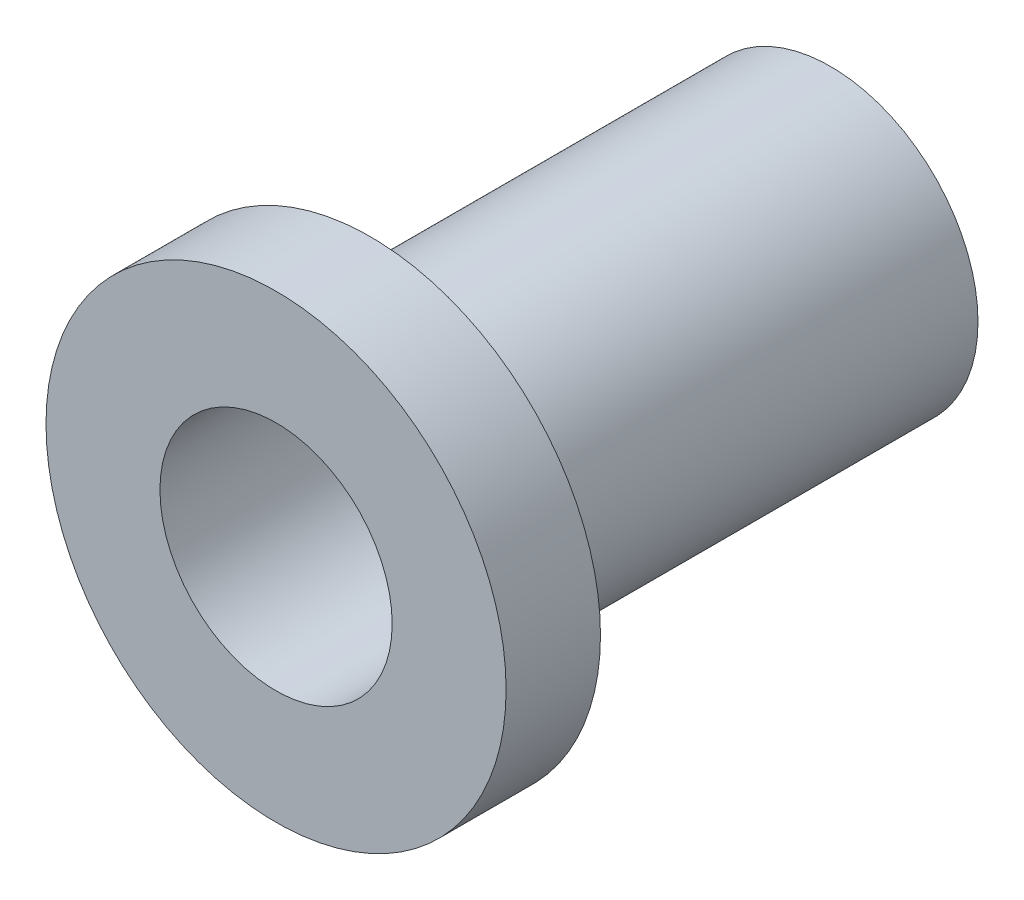
ISO-10303-21;
HEADER;
FILE_DESCRIPTION(('STEP AP214'),'2;1');
FILE_NAME('part.step','',(''),(''),'','','');
FILE_SCHEMA(('AUTOMOTIVE_DESIGN { 1 0 10303 214 1 1 1 1 }'));
ENDSEC;
DATA;
#1=APPLICATION_CONTEXT('core data for automotive mechanical design processes');
#2=APPLICATION_PROTOCOL_DEFINITION('international standard','automotive_design',2000,#1);
#3=PRODUCT_CONTEXT('',#1,'mechanical');
#4=PRODUCT('Part','Part','',(#3));
#5=PRODUCT_RELATED_PRODUCT_CATEGORY('part','',(#4));
#6=PRODUCT_DEFINITION_FORMATION('','',#4);
#7=PRODUCT_DEFINITION_CONTEXT('part definition',#1,'design');
#8=PRODUCT_DEFINITION('design','',#6,#7);
#9=PRODUCT_DEFINITION_SHAPE('','',#8);
#10=(LENGTH_UNIT() NAMED_UNIT(*) SI_UNIT(.MILLI.,.METRE.));
#11=(NAMED_UNIT(*) PLANE_ANGLE_UNIT() SI_UNIT($,.RADIAN.));
#12=(NAMED_UNIT(*) SI_UNIT($,.STERADIAN.) SOLID_ANGLE_UNIT());
#13=UNCERTAINTY_MEASURE_WITH_UNIT(LENGTH_MEASURE(1.E-05),#10,'distance_accuracy_value','');
#14=(GEOMETRIC_REPRESENTATION_CONTEXT(3) GLOBAL_UNCERTAINTY_ASSIGNED_CONTEXT((#13)) GLOBAL_UNIT_ASSIGNED_CONTEXT((#10,
#11,#12)) REPRESENTATION_CONTEXT('',''));
#15=CARTESIAN_POINT('',(0.,0.,0.));
#16=DIRECTION('',(0.,0.,1.));
#17=DIRECTION('',(1.,0.,0.));
#18=AXIS2_PLACEMENT_3D('',#15,#16,#17);
#19=CARTESIAN_POINT('',(0.,0.,2.032));
#20=DIRECTION('',(0.,0.,1.));
#21=DIRECTION('',(1.,0.,0.));
#22=AXIS2_PLACEMENT_3D('',#19,#20,#21);
#23=PLANE('',#22);
#24=CARTESIAN_POINT('',(0.,0.,2.032));
#25=DIRECTION('',(0.,0.,-1.));
#26=DIRECTION('',(-1.,0.,0.));
#27=AXIS2_PLACEMENT_3D('',#24,#25,#26);
#28=CIRCLE('',#27,2.5);
#29=CARTESIAN_POINT('',(-2.5,0.,2.032));
#30=VERTEX_POINT('',#29);
#31=EDGE_CURVE('E17',#30,#30,#28,.T.);
#32=ORIENTED_EDGE('',*,*,#31,.T.);
#33=EDGE_LOOP('',(#32));
#34=FACE_BOUND('',#33,.T.);
#35=CARTESIAN_POINT('',(0.,0.,2.032));
#36=DIRECTION('',(0.,0.,-1.));
#37=DIRECTION('',(-1.,0.,0.));
#38=AXIS2_PLACEMENT_3D('',#35,#36,#37);
#39=CIRCLE('',#38,4.953);
#40=CARTESIAN_POINT('',(-4.953,0.,2.032));
#41=VERTEX_POINT('',#40);
#42=EDGE_CURVE('E33',#41,#41,#39,.T.);
#43=ORIENTED_EDGE('',*,*,#42,.F.);
#44=EDGE_LOOP('',(#43));
#45=FACE_BOUND('',#44,.T.);
#46=ADVANCED_FACE('F14',(#34,#45),#23,.T.);
#47=CARTESIAN_POINT('',(0.,0.,2.032));
#48=DIRECTION('',(0.,0.,-1.));
#49=DIRECTION('',(-1.,0.,0.));
#50=AXIS2_PLACEMENT_3D('',#47,#48,#49);
#51=CYLINDRICAL_SURFACE('',#50,2.5);
#52=CARTESIAN_POINT('',(0.,0.,-9.906));
#53=DIRECTION('',(0.,0.,-1.));
#54=DIRECTION('',(-1.,0.,0.));
#55=AXIS2_PLACEMENT_3D('',#52,#53,#54);
#56=CIRCLE('',#55,2.5);
#57=CARTESIAN_POINT('',(-2.5,0.,-9.906));
#58=VERTEX_POINT('',#57);
#59=EDGE_CURVE('E31',#58,#58,#56,.F.);
#60=ORIENTED_EDGE('',*,*,#59,.F.);
#61=EDGE_LOOP('',(#60));
#62=FACE_BOUND('',#61,.T.);
#63=ORIENTED_EDGE('',*,*,#31,.F.);
#64=EDGE_LOOP('',(#63));
#65=FACE_BOUND('',#64,.T.);
#66=ADVANCED_FACE('F42',(#62,#65),#51,.F.);
#67=CARTESIAN_POINT('',(0.,0.,2.032));
#68=DIRECTION('',(0.,0.,-1.));
#69=DIRECTION('',(-1.,0.,0.));
#70=AXIS2_PLACEMENT_3D('',#67,#68,#69);
#71=CYLINDRICAL_SURFACE('',#70,4.953);
#72=ORIENTED_EDGE('',*,*,#42,.T.);
#73=EDGE_LOOP('',(#72));
#74=FACE_BOUND('',#73,.T.);
#75=CARTESIAN_POINT('',(0.,0.,0.));
#76=DIRECTION('',(0.,0.,-1.));
#77=DIRECTION('',(-1.,0.,0.));
#78=AXIS2_PLACEMENT_3D('',#75,#76,#77);
#79=CIRCLE('',#78,4.953);
#80=CARTESIAN_POINT('',(-4.953,0.,0.));
#81=VERTEX_POINT('',#80);
#82=EDGE_CURVE('E26',#81,#81,#79,.F.);
#83=ORIENTED_EDGE('',*,*,#82,.T.);
#84=EDGE_LOOP('',(#83));
#85=FACE_BOUND('',#84,.T.);
#86=ADVANCED_FACE('F44',(#74,#85),#71,.T.);
#87=CARTESIAN_POINT('',(0.,0.,-9.906));
#88=DIRECTION('',(0.,0.,-1.));
#89=DIRECTION('',(-1.,0.,0.));
#90=AXIS2_PLACEMENT_3D('',#87,#88,#89);
#91=PLANE('',#90);
#92=ORIENTED_EDGE('',*,*,#59,.T.);
#93=EDGE_LOOP('',(#92));
#94=FACE_BOUND('',#93,.T.);
#95=CARTESIAN_POINT('',(0.,0.,-9.906));
#96=DIRECTION('',(0.,0.,1.));
#97=DIRECTION('',(1.,0.,0.));
#98=AXIS2_PLACEMENT_3D('',#95,#96,#97);
#99=CIRCLE('',#98,3.175);
#100=CARTESIAN_POINT('',(3.175,0.,-9.906));
#101=VERTEX_POINT('',#100);
#102=EDGE_CURVE('E21',#101,#101,#99,.T.);
#103=ORIENTED_EDGE('',*,*,#102,.F.);
#104=EDGE_LOOP('',(#103));
#105=FACE_BOUND('',#104,.T.);
#106=ADVANCED_FACE('F51',(#94,#105),#91,.T.);
#107=CARTESIAN_POINT('',(0.,0.,0.));
#108=DIRECTION('',(0.,0.,1.));
#109=DIRECTION('',(1.,0.,0.));
#110=AXIS2_PLACEMENT_3D('',#107,#108,#109);
#111=PLANE('',#110);
#112=CARTESIAN_POINT('',(0.,0.,0.));
#113=DIRECTION('',(0.,0.,1.));
#114=DIRECTION('',(1.,0.,0.));
#115=AXIS2_PLACEMENT_3D('',#112,#113,#114);
#116=CIRCLE('',#115,3.175);
#117=CARTESIAN_POINT('',(3.175,0.,0.));
#118=VERTEX_POINT('',#117);
#119=EDGE_CURVE('E10',#118,#118,#116,.F.);
#120=ORIENTED_EDGE('',*,*,#119,.F.);
#121=EDGE_LOOP('',(#120));
#122=FACE_BOUND('',#121,.T.);
#123=ORIENTED_EDGE('',*,*,#82,.F.);
#124=EDGE_LOOP('',(#123));
#125=FACE_BOUND('',#124,.T.);
#126=ADVANCED_FACE('F57',(#122,#125),#111,.F.);
#127=CARTESIAN_POINT('',(0.,0.,-9.906));
#128=DIRECTION('',(0.,0.,1.));
#129=DIRECTION('',(1.,0.,0.));
#130=AXIS2_PLACEMENT_3D('',#127,#128,#129);
#131=CYLINDRICAL_SURFACE('',#130,3.175);
#132=ORIENTED_EDGE('',*,*,#119,.T.);
#133=EDGE_LOOP('',(#132));
#134=FACE_BOUND('',#133,.T.);
#135=ORIENTED_EDGE('',*,*,#102,.T.);
#136=EDGE_LOOP('',(#135));
#137=FACE_BOUND('',#136,.T.);
#138=ADVANCED_FACE('F55',(#134,#137),#131,.T.);
#139=CLOSED_SHELL('',(#46,#66,#86,#106,#126,#138));
#140=MANIFOLD_SOLID_BREP('B1',#139);
#141=ADVANCED_BREP_SHAPE_REPRESENTATION('',(#18,#140),#14);
#142=SHAPE_DEFINITION_REPRESENTATION(#9,#141);
ENDSEC;
END-ISO-10303-21;
